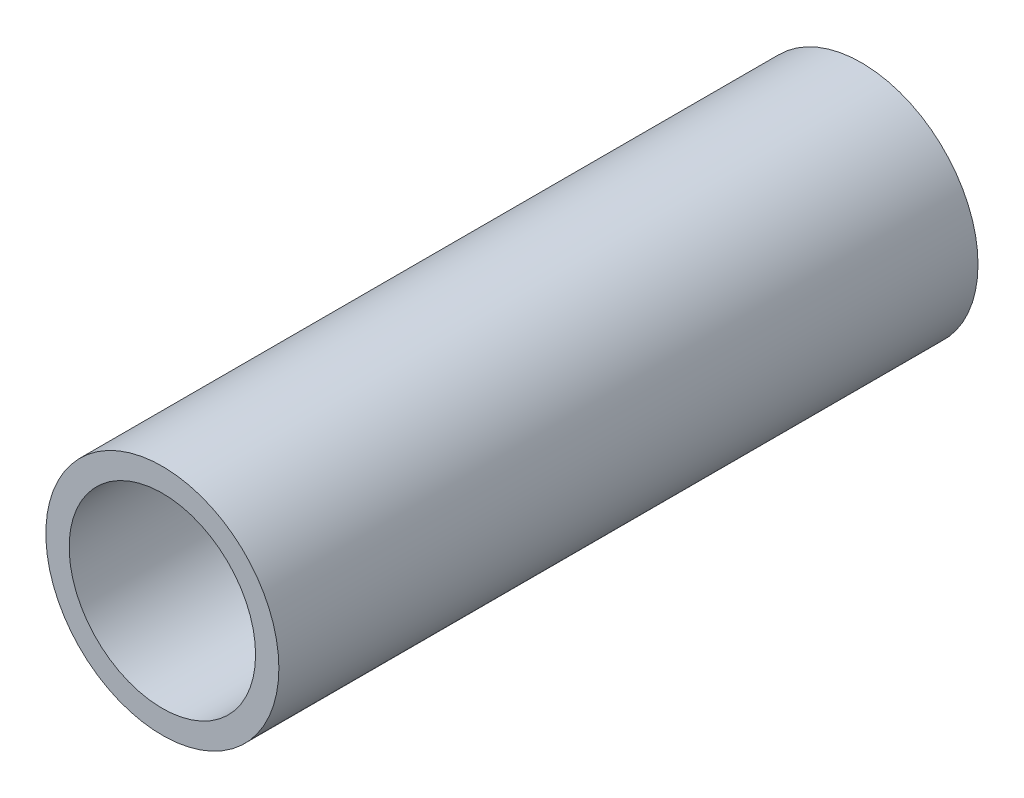
ISO-10303-21;
HEADER;
FILE_DESCRIPTION(('STEP AP214'),'2;1');
FILE_NAME('part.step','',(''),(''),'','','');
FILE_SCHEMA(('AUTOMOTIVE_DESIGN { 1 0 10303 214 1 1 1 1 }'));
ENDSEC;
DATA;
#1=APPLICATION_CONTEXT('core data for automotive mechanical design processes');
#2=APPLICATION_PROTOCOL_DEFINITION('international standard','automotive_design',2000,#1);
#3=PRODUCT_CONTEXT('',#1,'mechanical');
#4=PRODUCT('Part','Part','',(#3));
#5=PRODUCT_RELATED_PRODUCT_CATEGORY('part','',(#4));
#6=PRODUCT_DEFINITION_FORMATION('','',#4);
#7=PRODUCT_DEFINITION_CONTEXT('part definition',#1,'design');
#8=PRODUCT_DEFINITION('design','',#6,#7);
#9=PRODUCT_DEFINITION_SHAPE('','',#8);
#10=(LENGTH_UNIT() NAMED_UNIT(*) SI_UNIT(.MILLI.,.METRE.));
#11=(NAMED_UNIT(*) PLANE_ANGLE_UNIT() SI_UNIT($,.RADIAN.));
#12=(NAMED_UNIT(*) SI_UNIT($,.STERADIAN.) SOLID_ANGLE_UNIT());
#13=UNCERTAINTY_MEASURE_WITH_UNIT(LENGTH_MEASURE(1.E-05),#10,'distance_accuracy_value','');
#14=(GEOMETRIC_REPRESENTATION_CONTEXT(3) GLOBAL_UNCERTAINTY_ASSIGNED_CONTEXT((#13)) GLOBAL_UNIT_ASSIGNED_CONTEXT((#10,
#11,#12)) REPRESENTATION_CONTEXT('',''));
#15=CARTESIAN_POINT('',(0.,0.,0.));
#16=DIRECTION('',(0.,0.,1.));
#17=DIRECTION('',(1.,0.,0.));
#18=AXIS2_PLACEMENT_3D('',#15,#16,#17);
#19=CARTESIAN_POINT('',(0.,0.,76.2));
#20=DIRECTION('',(0.,0.,1.));
#21=DIRECTION('',(1.,0.,0.));
#22=AXIS2_PLACEMENT_3D('',#19,#20,#21);
#23=PLANE('',#22);
#24=CARTESIAN_POINT('',(0.,0.,76.2));
#25=DIRECTION('',(0.,0.,1.));
#26=DIRECTION('',(1.,0.,0.));
#27=AXIS2_PLACEMENT_3D('',#24,#25,#26);
#28=CIRCLE('',#27,12.7);
#29=CARTESIAN_POINT('',(12.7,0.,76.2));
#30=VERTEX_POINT('',#29);
#31=EDGE_CURVE('E10',#30,#30,#28,.T.);
#32=ORIENTED_EDGE('',*,*,#31,.T.);
#33=EDGE_LOOP('',(#32));
#34=FACE_BOUND('',#33,.T.);
#35=CARTESIAN_POINT('',(0.,0.,76.2));
#36=DIRECTION('',(0.,0.,1.));
#37=DIRECTION('',(1.,0.,0.));
#38=AXIS2_PLACEMENT_3D('',#35,#36,#37);
#39=CIRCLE('',#38,10.16);
#40=CARTESIAN_POINT('',(10.16,0.,76.2));
#41=VERTEX_POINT('',#40);
#42=EDGE_CURVE('E41',#41,#41,#39,.T.);
#43=ORIENTED_EDGE('',*,*,#42,.F.);
#44=EDGE_LOOP('',(#43));
#45=FACE_BOUND('',#44,.T.);
#46=ADVANCED_FACE('F30',(#34,#45),#23,.T.);
#47=CARTESIAN_POINT('',(0.,0.,0.));
#48=DIRECTION('',(0.,0.,1.));
#49=DIRECTION('',(1.,0.,0.));
#50=AXIS2_PLACEMENT_3D('',#47,#48,#49);
#51=PLANE('',#50);
#52=CARTESIAN_POINT('',(0.,0.,0.));
#53=DIRECTION('',(0.,0.,1.));
#54=DIRECTION('',(1.,0.,0.));
#55=AXIS2_PLACEMENT_3D('',#52,#53,#54);
#56=CIRCLE('',#55,12.7);
#57=CARTESIAN_POINT('',(12.7,0.,0.));
#58=VERTEX_POINT('',#57);
#59=EDGE_CURVE('E34',#58,#58,#56,.T.);
#60=ORIENTED_EDGE('',*,*,#59,.F.);
#61=EDGE_LOOP('',(#60));
#62=FACE_BOUND('',#61,.T.);
#63=CARTESIAN_POINT('',(0.,0.,0.));
#64=DIRECTION('',(0.,0.,1.));
#65=DIRECTION('',(1.,0.,0.));
#66=AXIS2_PLACEMENT_3D('',#63,#64,#65);
#67=CIRCLE('',#66,10.16);
#68=CARTESIAN_POINT('',(10.16,0.,0.));
#69=VERTEX_POINT('',#68);
#70=EDGE_CURVE('E43',#69,#69,#67,.T.);
#71=ORIENTED_EDGE('',*,*,#70,.T.);
#72=EDGE_LOOP('',(#71));
#73=FACE_BOUND('',#72,.T.);
#74=ADVANCED_FACE('F53',(#62,#73),#51,.F.);
#75=CARTESIAN_POINT('',(0.,0.,76.2));
#76=DIRECTION('',(0.,0.,-1.));
#77=DIRECTION('',(-1.,0.,0.));
#78=AXIS2_PLACEMENT_3D('',#75,#76,#77);
#79=CYLINDRICAL_SURFACE('',#78,12.7);
#80=ORIENTED_EDGE('',*,*,#31,.F.);
#81=EDGE_LOOP('',(#80));
#82=FACE_BOUND('',#81,.T.);
#83=ORIENTED_EDGE('',*,*,#59,.T.);
#84=EDGE_LOOP('',(#83));
#85=FACE_BOUND('',#84,.T.);
#86=ADVANCED_FACE('F32',(#82,#85),#79,.T.);
#87=CARTESIAN_POINT('',(0.,0.,76.2));
#88=DIRECTION('',(0.,0.,-1.));
#89=DIRECTION('',(-1.,0.,0.));
#90=AXIS2_PLACEMENT_3D('',#87,#88,#89);
#91=CYLINDRICAL_SURFACE('',#90,10.16);
#92=ORIENTED_EDGE('',*,*,#42,.T.);
#93=EDGE_LOOP('',(#92));
#94=FACE_BOUND('',#93,.T.);
#95=ORIENTED_EDGE('',*,*,#70,.F.);
#96=EDGE_LOOP('',(#95));
#97=FACE_BOUND('',#96,.T.);
#98=ADVANCED_FACE('F49',(#94,#97),#91,.F.);
#99=CLOSED_SHELL('',(#46,#74,#86,#98));
#100=MANIFOLD_SOLID_BREP('B2',#99);
#101=ADVANCED_BREP_SHAPE_REPRESENTATION('',(#18,#100),#14);
#102=SHAPE_DEFINITION_REPRESENTATION(#9,#101);
ENDSEC;
END-ISO-10303-21;
